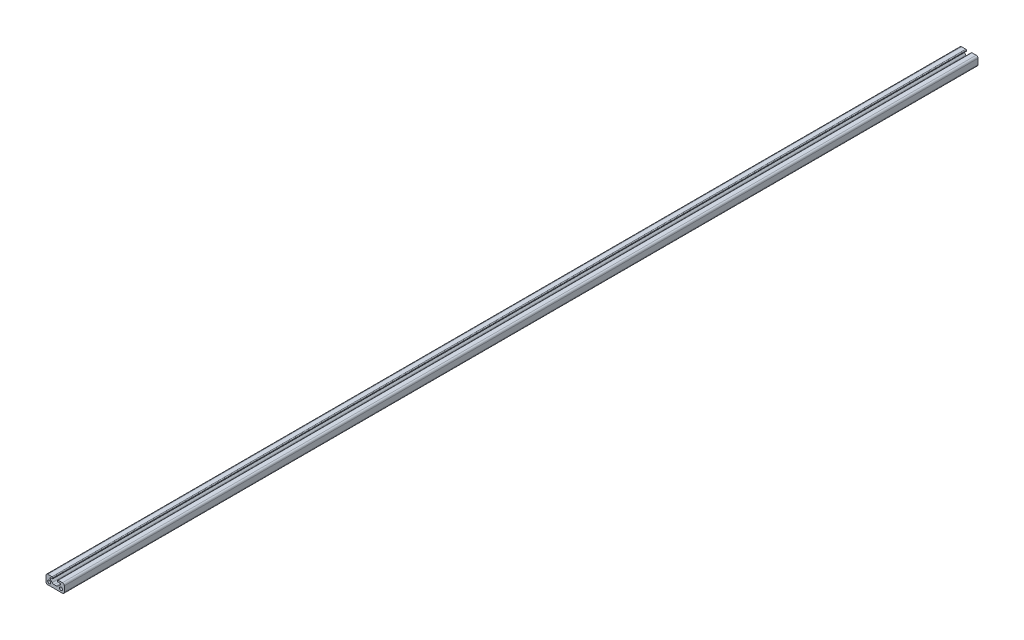
ISO-10303-21;
HEADER;
FILE_DESCRIPTION(('STEP AP214'),'2;1');
FILE_NAME('part.step','',(''),(''),'','','');
FILE_SCHEMA(('AUTOMOTIVE_DESIGN { 1 0 10303 214 1 1 1 1 }'));
ENDSEC;
DATA;
#1=APPLICATION_CONTEXT('core data for automotive mechanical design processes');
#2=APPLICATION_PROTOCOL_DEFINITION('international standard','automotive_design',2000,#1);
#3=PRODUCT_CONTEXT('',#1,'mechanical');
#4=PRODUCT('Part','Part','',(#3));
#5=PRODUCT_RELATED_PRODUCT_CATEGORY('part','',(#4));
#6=PRODUCT_DEFINITION_FORMATION('','',#4);
#7=PRODUCT_DEFINITION_CONTEXT('part definition',#1,'design');
#8=PRODUCT_DEFINITION('design','',#6,#7);
#9=PRODUCT_DEFINITION_SHAPE('','',#8);
#10=(LENGTH_UNIT() NAMED_UNIT(*) SI_UNIT(.MILLI.,.METRE.));
#11=(NAMED_UNIT(*) PLANE_ANGLE_UNIT() SI_UNIT($,.RADIAN.));
#12=(NAMED_UNIT(*) SI_UNIT($,.STERADIAN.) SOLID_ANGLE_UNIT());
#13=UNCERTAINTY_MEASURE_WITH_UNIT(LENGTH_MEASURE(1.E-05),#10,'distance_accuracy_value','');
#14=(GEOMETRIC_REPRESENTATION_CONTEXT(3) GLOBAL_UNCERTAINTY_ASSIGNED_CONTEXT((#13)) GLOBAL_UNIT_ASSIGNED_CONTEXT((#10,
#11,#12)) REPRESENTATION_CONTEXT('',''));
#15=CARTESIAN_POINT('',(0.,0.,0.));
#16=DIRECTION('',(0.,0.,1.));
#17=DIRECTION('',(1.,0.,0.));
#18=AXIS2_PLACEMENT_3D('',#15,#16,#17);
#19=CARTESIAN_POINT('',(10.575000000008,8.50000076294464,0.));
#20=DIRECTION('',(-1.,0.,0.));
#21=DIRECTION('',(0.,0.,1.));
#22=AXIS2_PLACEMENT_3D('',#19,#20,#21);
#23=PLANE('',#22);
#24=DIRECTION('',(0.,1.,0.));
#25=VECTOR('',#24,1.);
#26=CARTESIAN_POINT('',(10.575000000008,8.50000076294464,0.));
#27=LINE('',#26,#25);
#28=CARTESIAN_POINT('',(10.5750000000081,9.20000000000186,0.));
#29=VERTEX_POINT('',#28);
#30=CARTESIAN_POINT('',(10.5750000000071,8.50000076294464,0.));
#31=VERTEX_POINT('',#30);
#32=EDGE_CURVE('E198',#29,#31,#27,.F.);
#33=ORIENTED_EDGE('',*,*,#32,.T.);
#34=DIRECTION('',(0.,0.,1.));
#35=VECTOR('',#34,1.);
#36=CARTESIAN_POINT('',(10.5750000000062,8.50000076294464,0.));
#37=LINE('',#36,#35);
#38=CARTESIAN_POINT('',(10.5750000000071,8.50000076294464,1000.));
#39=VERTEX_POINT('',#38);
#40=EDGE_CURVE('E195',#39,#31,#37,.F.);
#41=ORIENTED_EDGE('',*,*,#40,.F.);
#42=DIRECTION('',(0.,1.,0.));
#43=VECTOR('',#42,1.);
#44=CARTESIAN_POINT('',(10.575000000008,8.50000076294464,1000.));
#45=LINE('',#44,#43);
#46=CARTESIAN_POINT('',(10.5750000000081,9.20000000000186,1000.));
#47=VERTEX_POINT('',#46);
#48=EDGE_CURVE('E178',#39,#47,#45,.T.);
#49=ORIENTED_EDGE('',*,*,#48,.T.);
#50=DIRECTION('',(0.,0.,1.));
#51=VECTOR('',#50,1.);
#52=CARTESIAN_POINT('',(10.5750000000081,9.19999999999845,0.));
#53=LINE('',#52,#51);
#54=EDGE_CURVE('E192',#29,#47,#53,.T.);
#55=ORIENTED_EDGE('',*,*,#54,.F.);
#56=EDGE_LOOP('',(#33,#41,#49,#55));
#57=FACE_BOUND('',#56,.T.);
#58=ADVANCED_FACE('F16',(#57),#23,.T.);
#59=CARTESIAN_POINT('',(5.42500000000473,9.20000000000073,0.));
#60=DIRECTION('',(1.,0.,0.));
#61=DIRECTION('',(0.,0.,-1.));
#62=AXIS2_PLACEMENT_3D('',#59,#60,#61);
#63=PLANE('',#62);
#64=DIRECTION('',(0.,1.,0.));
#65=VECTOR('',#64,1.);
#66=CARTESIAN_POINT('',(5.42500000000473,9.20000000000073,0.));
#67=LINE('',#66,#65);
#68=CARTESIAN_POINT('',(5.42500000000743,8.50000076294918,0.));
#69=VERTEX_POINT('',#68);
#70=CARTESIAN_POINT('',(5.42500000000643,9.19999999999845,0.));
#71=VERTEX_POINT('',#70);
#72=EDGE_CURVE('E189',#69,#71,#67,.T.);
#73=ORIENTED_EDGE('',*,*,#72,.T.);
#74=DIRECTION('',(0.,0.,1.));
#75=VECTOR('',#74,1.);
#76=CARTESIAN_POINT('',(5.42500000000814,9.19999999999845,0.));
#77=LINE('',#76,#75);
#78=CARTESIAN_POINT('',(5.42500000000643,9.19999999999845,1000.));
#79=VERTEX_POINT('',#78);
#80=EDGE_CURVE('E302',#79,#71,#77,.F.);
#81=ORIENTED_EDGE('',*,*,#80,.F.);
#82=DIRECTION('',(0.,1.,0.));
#83=VECTOR('',#82,1.);
#84=CARTESIAN_POINT('',(5.42500000000473,9.20000000000073,1000.));
#85=LINE('',#84,#83);
#86=CARTESIAN_POINT('',(5.42500000000743,8.50000076294918,1000.));
#87=VERTEX_POINT('',#86);
#88=EDGE_CURVE('E326',#79,#87,#85,.F.);
#89=ORIENTED_EDGE('',*,*,#88,.T.);
#90=DIRECTION('',(0.,0.,1.));
#91=VECTOR('',#90,1.);
#92=CARTESIAN_POINT('',(5.42500000001013,8.50000076294918,0.));
#93=LINE('',#92,#91);
#94=EDGE_CURVE('E307',#69,#87,#93,.T.);
#95=ORIENTED_EDGE('',*,*,#94,.F.);
#96=EDGE_LOOP('',(#73,#81,#89,#95));
#97=FACE_BOUND('',#96,.T.);
#98=ADVANCED_FACE('F506',(#97),#63,.T.);
#99=CARTESIAN_POINT('',(11.3750000000027,9.20000000000528,0.));
#100=DIRECTION('',(0.,0.,1.));
#101=DIRECTION('',(1.,0.,0.));
#102=AXIS2_PLACEMENT_3D('',#99,#100,#101);
#103=CYLINDRICAL_SURFACE('',#102,0.799999999994583);
#104=CARTESIAN_POINT('',(11.3750000000027,9.20000000000528,0.));
#105=DIRECTION('',(0.,0.,1.));
#106=DIRECTION('',(1.,0.,0.));
#107=AXIS2_PLACEMENT_3D('',#104,#105,#106);
#108=CIRCLE('',#107,0.799999999994583);
#109=CARTESIAN_POINT('',(11.375000000005,10.0000000000011,0.));
#110=VERTEX_POINT('',#109);
#111=EDGE_CURVE('E188',#110,#29,#108,.T.);
#112=ORIENTED_EDGE('',*,*,#111,.T.);
#113=ORIENTED_EDGE('',*,*,#54,.T.);
#114=CARTESIAN_POINT('',(11.3750000000027,9.20000000000528,1000.));
#115=DIRECTION('',(0.,0.,1.));
#116=DIRECTION('',(1.,0.,0.));
#117=AXIS2_PLACEMENT_3D('',#114,#115,#116);
#118=CIRCLE('',#117,0.799999999994583);
#119=CARTESIAN_POINT('',(11.375000000005,10.0000000000011,1000.));
#120=VERTEX_POINT('',#119);
#121=EDGE_CURVE('E19',#47,#120,#118,.F.);
#122=ORIENTED_EDGE('',*,*,#121,.T.);
#123=DIRECTION('',(0.,0.,1.));
#124=VECTOR('',#123,1.);
#125=CARTESIAN_POINT('',(11.3750000000073,10.0000000000023,0.));
#126=LINE('',#125,#124);
#127=EDGE_CURVE('E344',#110,#120,#126,.T.);
#128=ORIENTED_EDGE('',*,*,#127,.F.);
#129=EDGE_LOOP('',(#112,#113,#122,#128));
#130=FACE_BOUND('',#129,.T.);
#131=ADVANCED_FACE('F200',(#130),#103,.T.);
#132=CARTESIAN_POINT('',(10.8750000000055,8.50000076294464,0.));
#133=DIRECTION('',(0.,0.,1.));
#134=DIRECTION('',(1.,0.,0.));
#135=AXIS2_PLACEMENT_3D('',#132,#133,#134);
#136=CYLINDRICAL_SURFACE('',#135,0.299999999999301);
#137=CARTESIAN_POINT('',(10.8750000000055,8.50000076294464,0.));
#138=DIRECTION('',(0.,0.,1.));
#139=DIRECTION('',(1.,0.,0.));
#140=AXIS2_PLACEMENT_3D('',#137,#138,#139);
#141=CIRCLE('',#140,0.299999999999301);
#142=CARTESIAN_POINT('',(10.874999945961,8.20000076294491,0.));
#143=VERTEX_POINT('',#142);
#144=EDGE_CURVE('E315',#31,#143,#141,.T.);
#145=ORIENTED_EDGE('',*,*,#144,.T.);
#146=DIRECTION('',(0.,0.,1.));
#147=VECTOR('',#146,1.);
#148=CARTESIAN_POINT('',(10.8749998919166,8.20000076294491,0.));
#149=LINE('',#148,#147);
#150=CARTESIAN_POINT('',(10.874999945961,8.20000076294491,1000.));
#151=VERTEX_POINT('',#150);
#152=EDGE_CURVE('E347',#151,#143,#149,.F.);
#153=ORIENTED_EDGE('',*,*,#152,.F.);
#154=CARTESIAN_POINT('',(10.8750000000055,8.50000076294464,1000.));
#155=DIRECTION('',(0.,0.,1.));
#156=DIRECTION('',(1.,0.,0.));
#157=AXIS2_PLACEMENT_3D('',#154,#155,#156);
#158=CIRCLE('',#157,0.299999999999301);
#159=EDGE_CURVE('E202',#151,#39,#158,.F.);
#160=ORIENTED_EDGE('',*,*,#159,.T.);
#161=ORIENTED_EDGE('',*,*,#40,.T.);
#162=EDGE_LOOP('',(#145,#153,#160,#161));
#163=FACE_BOUND('',#162,.T.);
#164=ADVANCED_FACE('F494',(#163),#136,.T.);
#165=CARTESIAN_POINT('',(5.12500000000728,8.50000076294918,0.));
#166=DIRECTION('',(0.,0.,1.));
#167=DIRECTION('',(1.,0.,0.));
#168=AXIS2_PLACEMENT_3D('',#165,#166,#167);
#169=CYLINDRICAL_SURFACE('',#168,0.300000000002853);
#170=CARTESIAN_POINT('',(5.12500000000728,8.50000076294918,0.));
#171=DIRECTION('',(0.,0.,1.));
#172=DIRECTION('',(1.,0.,0.));
#173=AXIS2_PLACEMENT_3D('',#170,#171,#172);
#174=CIRCLE('',#173,0.300000000002853);
#175=CARTESIAN_POINT('',(5.12500005446782,8.2000003691735,0.));
#176=VERTEX_POINT('',#175);
#177=EDGE_CURVE('E308',#176,#69,#174,.T.);
#178=ORIENTED_EDGE('',*,*,#177,.T.);
#179=ORIENTED_EDGE('',*,*,#94,.T.);
#180=CARTESIAN_POINT('',(5.12500000000728,8.50000076294918,1000.));
#181=DIRECTION('',(0.,0.,1.));
#182=DIRECTION('',(1.,0.,0.));
#183=AXIS2_PLACEMENT_3D('',#180,#181,#182);
#184=CIRCLE('',#183,0.300000000002853);
#185=CARTESIAN_POINT('',(5.12500005446782,8.2000003691735,1000.));
#186=VERTEX_POINT('',#185);
#187=EDGE_CURVE('E312',#87,#186,#184,.F.);
#188=ORIENTED_EDGE('',*,*,#187,.T.);
#189=DIRECTION('',(0.,0.,1.));
#190=VECTOR('',#189,1.);
#191=CARTESIAN_POINT('',(5.12500010892836,8.20000076294491,0.));
#192=LINE('',#191,#190);
#193=EDGE_CURVE('E378',#176,#186,#192,.T.);
#194=ORIENTED_EDGE('',*,*,#193,.F.);
#195=EDGE_LOOP('',(#178,#179,#188,#194));
#196=FACE_BOUND('',#195,.T.);
#197=ADVANCED_FACE('F496',(#196),#169,.T.);
#198=CARTESIAN_POINT('',(4.62500000001,9.19999999999845,0.));
#199=DIRECTION('',(0.,0.,1.));
#200=DIRECTION('',(1.,0.,0.));
#201=AXIS2_PLACEMENT_3D('',#198,#199,#200);
#202=CYLINDRICAL_SURFACE('',#201,0.799999999998135);
#203=CARTESIAN_POINT('',(4.62500000001,9.19999999999845,0.));
#204=DIRECTION('',(0.,0.,1.));
#205=DIRECTION('',(1.,0.,0.));
#206=AXIS2_PLACEMENT_3D('',#203,#204,#205);
#207=CIRCLE('',#206,0.799999999998135);
#208=CARTESIAN_POINT('',(4.62500000000773,9.99999999999773,0.));
#209=VERTEX_POINT('',#208);
#210=EDGE_CURVE('E298',#71,#209,#207,.T.);
#211=ORIENTED_EDGE('',*,*,#210,.T.);
#212=DIRECTION('',(0.,0.,1.));
#213=VECTOR('',#212,1.);
#214=CARTESIAN_POINT('',(4.62500000000546,9.99999999999773,0.));
#215=LINE('',#214,#213);
#216=CARTESIAN_POINT('',(4.62500000000773,9.99999999999773,1000.));
#217=VERTEX_POINT('',#216);
#218=EDGE_CURVE('E382',#217,#209,#215,.F.);
#219=ORIENTED_EDGE('',*,*,#218,.F.);
#220=CARTESIAN_POINT('',(4.62500000001,9.19999999999845,1000.));
#221=DIRECTION('',(0.,0.,1.));
#222=DIRECTION('',(1.,0.,0.));
#223=AXIS2_PLACEMENT_3D('',#220,#221,#222);
#224=CIRCLE('',#223,0.799999999998135);
#225=EDGE_CURVE('E303',#217,#79,#224,.F.);
#226=ORIENTED_EDGE('',*,*,#225,.T.);
#227=ORIENTED_EDGE('',*,*,#80,.T.);
#228=EDGE_LOOP('',(#211,#219,#226,#227));
#229=FACE_BOUND('',#228,.T.);
#230=ADVANCED_FACE('F503',(#229),#202,.T.);
#231=CARTESIAN_POINT('',(16.0000000000082,7.99999999999955,0.));
#232=DIRECTION('',(0.,0.,1.));
#233=DIRECTION('',(1.,0.,0.));
#234=AXIS2_PLACEMENT_3D('',#231,#232,#233);
#235=CYLINDRICAL_SURFACE('',#234,1.99999999999889);
#236=CARTESIAN_POINT('',(16.0000000000082,7.99999999999955,0.));
#237=DIRECTION('',(0.,0.,1.));
#238=DIRECTION('',(1.,0.,0.));
#239=AXIS2_PLACEMENT_3D('',#236,#237,#238);
#240=CIRCLE('',#239,1.99999999999889);
#241=CARTESIAN_POINT('',(18.0000000000041,7.99999999999841,0.));
#242=VERTEX_POINT('',#241);
#243=CARTESIAN_POINT('',(16.0000000000082,10.,0.));
#244=VERTEX_POINT('',#243);
#245=EDGE_CURVE('E250',#242,#244,#240,.T.);
#246=ORIENTED_EDGE('',*,*,#245,.T.);
#247=DIRECTION('',(0.,0.,1.));
#248=VECTOR('',#247,1.);
#249=CARTESIAN_POINT('',(16.0000000000082,10.,0.));
#250=LINE('',#249,#248);
#251=CARTESIAN_POINT('',(16.0000000000082,10.,1000.));
#252=VERTEX_POINT('',#251);
#253=EDGE_CURVE('E301',#252,#244,#250,.F.);
#254=ORIENTED_EDGE('',*,*,#253,.F.);
#255=CARTESIAN_POINT('',(16.0000000000082,7.99999999999955,1000.));
#256=DIRECTION('',(0.,0.,1.));
#257=DIRECTION('',(1.,0.,0.));
#258=AXIS2_PLACEMENT_3D('',#255,#256,#257);
#259=CIRCLE('',#258,1.99999999999889);
#260=CARTESIAN_POINT('',(18.0000000000041,7.99999999999841,1000.));
#261=VERTEX_POINT('',#260);
#262=EDGE_CURVE('E294',#261,#252,#259,.T.);
#263=ORIENTED_EDGE('',*,*,#262,.F.);
#264=DIRECTION('',(0.,0.,1.));
#265=VECTOR('',#264,1.);
#266=CARTESIAN_POINT('',(18.0000000000064,7.99999999999727,0.));
#267=LINE('',#266,#265);
#268=EDGE_CURVE('E339',#242,#261,#267,.T.);
#269=ORIENTED_EDGE('',*,*,#268,.F.);
#270=EDGE_LOOP('',(#246,#254,#263,#269));
#271=FACE_BOUND('',#270,.T.);
#272=ADVANCED_FACE('F479',(#271),#235,.T.);
#273=CARTESIAN_POINT('',(11.3750000000073,10.0000000000023,0.));
#274=DIRECTION('',(4.916188E-13,1.,0.));
#275=DIRECTION('',(-1.,4.916188E-13,0.));
#276=AXIS2_PLACEMENT_3D('',#273,#274,#275);
#277=PLANE('',#276);
#278=DIRECTION('',(1.,0.,0.));
#279=VECTOR('',#278,1.);
#280=CARTESIAN_POINT('',(8.0000000011056,10.,0.));
#281=LINE('',#280,#279);
#282=EDGE_CURVE('E253',#244,#110,#281,.F.);
#283=ORIENTED_EDGE('',*,*,#282,.T.);
#284=ORIENTED_EDGE('',*,*,#127,.T.);
#285=DIRECTION('',(1.,0.,0.));
#286=VECTOR('',#285,1.);
#287=CARTESIAN_POINT('',(8.00000000110561,10.,1000.));
#288=LINE('',#287,#286);
#289=EDGE_CURVE('E182',#252,#120,#288,.F.);
#290=ORIENTED_EDGE('',*,*,#289,.F.);
#291=ORIENTED_EDGE('',*,*,#253,.T.);
#292=EDGE_LOOP('',(#283,#284,#290,#291));
#293=FACE_BOUND('',#292,.T.);
#294=ADVANCED_FACE('F482',(#293),#277,.T.);
#295=CARTESIAN_POINT('',(13.0441214776829,8.19999998142976,0.));
#296=DIRECTION('',(-3.60291078E-07,-0.999999999999935,0.));
#297=DIRECTION('',(0.999999999999935,-3.60291078E-07,0.));
#298=AXIS2_PLACEMENT_3D('',#295,#296,#297);
#299=PLANE('',#298);
#300=DIRECTION('',(1.,0.,0.));
#301=VECTOR('',#300,1.);
#302=CARTESIAN_POINT('',(8.0000000011056,8.20000076294491,0.));
#303=LINE('',#302,#301);
#304=CARTESIAN_POINT('',(13.0441213371682,8.20000037218916,0.));
#305=VERTEX_POINT('',#304);
#306=EDGE_CURVE('E249',#143,#305,#303,.T.);
#307=ORIENTED_EDGE('',*,*,#306,.T.);
#308=DIRECTION('',(0.,0.,1.));
#309=VECTOR('',#308,1.);
#310=CARTESIAN_POINT('',(13.0441214776829,8.1999999814334,0.));
#311=LINE('',#310,#309);
#312=CARTESIAN_POINT('',(13.0441213371682,8.20000037218916,1000.));
#313=VERTEX_POINT('',#312);
#314=EDGE_CURVE('E353',#305,#313,#311,.T.);
#315=ORIENTED_EDGE('',*,*,#314,.T.);
#316=DIRECTION('',(1.,0.,0.));
#317=VECTOR('',#316,1.);
#318=CARTESIAN_POINT('',(8.00000000110561,8.20000076294491,1000.));
#319=LINE('',#318,#317);
#320=EDGE_CURVE('E293',#151,#313,#319,.T.);
#321=ORIENTED_EDGE('',*,*,#320,.F.);
#322=ORIENTED_EDGE('',*,*,#152,.T.);
#323=EDGE_LOOP('',(#307,#315,#321,#322));
#324=FACE_BOUND('',#323,.T.);
#325=ADVANCED_FACE('F488',(#324),#299,.T.);
#326=CARTESIAN_POINT('',(13.0441211966536,7.41999998143456,0.));
#327=DIRECTION('',(0.,0.,1.));
#328=DIRECTION('',(1.,0.,0.));
#329=AXIS2_PLACEMENT_3D('',#326,#327,#328);
#330=CYLINDRICAL_SURFACE('',#329,0.779999999998893);
#331=ORIENTED_EDGE('',*,*,#314,.F.);
#332=CARTESIAN_POINT('',(13.0441211966536,7.41999998143456,0.));
#333=DIRECTION('',(0.,0.,1.));
#334=DIRECTION('',(1.,0.,0.));
#335=AXIS2_PLACEMENT_3D('',#332,#333,#334);
#336=CIRCLE('',#335,0.779999999998893);
#337=CARTESIAN_POINT('',(13.5956644859832,6.86845669210219,0.));
#338=VERTEX_POINT('',#337);
#339=EDGE_CURVE('E246',#305,#338,#336,.F.);
#340=ORIENTED_EDGE('',*,*,#339,.T.);
#341=DIRECTION('',(0.,0.,1.));
#342=VECTOR('',#341,1.);
#343=CARTESIAN_POINT('',(13.5956644859834,6.86845669210243,0.));
#344=LINE('',#343,#342);
#345=CARTESIAN_POINT('',(13.5956644859832,6.86845669210219,1000.));
#346=VERTEX_POINT('',#345);
#347=EDGE_CURVE('E356',#346,#338,#344,.F.);
#348=ORIENTED_EDGE('',*,*,#347,.F.);
#349=CARTESIAN_POINT('',(13.0441211966536,7.41999998143456,1000.));
#350=DIRECTION('',(0.,0.,1.));
#351=DIRECTION('',(1.,0.,0.));
#352=AXIS2_PLACEMENT_3D('',#349,#350,#351);
#353=CIRCLE('',#352,0.779999999998893);
#354=EDGE_CURVE('E289',#313,#346,#353,.F.);
#355=ORIENTED_EDGE('',*,*,#354,.F.);
#356=EDGE_LOOP('',(#331,#340,#348,#355));
#357=FACE_BOUND('',#356,.T.);
#358=ADVANCED_FACE('F492',(#357),#330,.F.);
#359=CARTESIAN_POINT('',(11.2558874551951,4.52867966132771,0.));
#360=DIRECTION('',(-0.707106781184486,0.707106781188609,0.));
#361=DIRECTION('',(-0.707106781188609,-0.707106781184486,0.));
#362=AXIS2_PLACEMENT_3D('',#359,#360,#361);
#363=PLANE('',#362);
#364=DIRECTION('',(-0.707106781188609,-0.707106781184486,0.));
#365=VECTOR('',#364,1.);
#366=CARTESIAN_POINT('',(13.5956644859834,6.86845669210243,0.));
#367=LINE('',#366,#365);
#368=CARTESIAN_POINT('',(11.255887455188,4.52867966132182,0.));
#369=VERTEX_POINT('',#368);
#370=EDGE_CURVE('E245',#338,#369,#367,.T.);
#371=ORIENTED_EDGE('',*,*,#370,.T.);
#372=DIRECTION('',(0.,0.,1.));
#373=VECTOR('',#372,1.);
#374=CARTESIAN_POINT('',(11.2558874551939,4.52867966132892,0.));
#375=LINE('',#374,#373);
#376=CARTESIAN_POINT('',(11.255887455188,4.52867966132182,1000.));
#377=VERTEX_POINT('',#376);
#378=EDGE_CURVE('E360',#369,#377,#375,.T.);
#379=ORIENTED_EDGE('',*,*,#378,.T.);
#380=DIRECTION('',(-0.707106781188609,-0.707106781184486,0.));
#381=VECTOR('',#380,1.);
#382=CARTESIAN_POINT('',(13.5956644859834,6.86845669210243,1000.));
#383=LINE('',#382,#381);
#384=EDGE_CURVE('E288',#346,#377,#383,.T.);
#385=ORIENTED_EDGE('',*,*,#384,.F.);
#386=ORIENTED_EDGE('',*,*,#347,.T.);
#387=EDGE_LOOP('',(#371,#379,#385,#386));
#388=FACE_BOUND('',#387,.T.);
#389=ADVANCED_FACE('F566',(#388),#363,.T.);
#390=CARTESIAN_POINT('',(9.13456711163235,6.6500000048768,0.));
#391=DIRECTION('',(0.,0.,1.));
#392=DIRECTION('',(1.,0.,0.));
#393=AXIS2_PLACEMENT_3D('',#390,#391,#392);
#394=CYLINDRICAL_SURFACE('',#393,2.99999999999301);
#395=ORIENTED_EDGE('',*,*,#378,.F.);
#396=CARTESIAN_POINT('',(9.13456711163235,6.6500000048768,0.));
#397=DIRECTION('',(0.,0.,1.));
#398=DIRECTION('',(1.,0.,0.));
#399=AXIS2_PLACEMENT_3D('',#396,#397,#398);
#400=CIRCLE('',#399,2.99999999999301);
#401=CARTESIAN_POINT('',(9.13456711475192,3.65000000488408,0.));
#402=VERTEX_POINT('',#401);
#403=EDGE_CURVE('E242',#369,#402,#400,.F.);
#404=ORIENTED_EDGE('',*,*,#403,.T.);
#405=DIRECTION('',(0.,0.,1.));
#406=VECTOR('',#405,1.);
#407=CARTESIAN_POINT('',(9.13456711787149,3.65000000488408,0.));
#408=LINE('',#407,#406);
#409=CARTESIAN_POINT('',(9.13456711475192,3.65000000488408,1000.));
#410=VERTEX_POINT('',#409);
#411=EDGE_CURVE('E363',#410,#402,#408,.F.);
#412=ORIENTED_EDGE('',*,*,#411,.F.);
#413=CARTESIAN_POINT('',(9.13456711163235,6.6500000048768,1000.));
#414=DIRECTION('',(0.,0.,1.));
#415=DIRECTION('',(1.,0.,0.));
#416=AXIS2_PLACEMENT_3D('',#413,#414,#415);
#417=CIRCLE('',#416,2.99999999999301);
#418=EDGE_CURVE('E284',#377,#410,#417,.F.);
#419=ORIENTED_EDGE('',*,*,#418,.F.);
#420=EDGE_LOOP('',(#395,#404,#412,#419));
#421=FACE_BOUND('',#420,.T.);
#422=ADVANCED_FACE('F562',(#421),#394,.F.);
#423=CARTESIAN_POINT('',(6.86543289934434,3.65000000016153,0.));
#424=DIRECTION('',(-2.081213E-09,1.,0.));
#425=DIRECTION('',(-1.,-2.081213E-09,0.));
#426=AXIS2_PLACEMENT_3D('',#423,#424,#425);
#427=PLANE('',#426);
#428=DIRECTION('',(1.,0.,0.));
#429=VECTOR('',#428,1.);
#430=CARTESIAN_POINT('',(8.0000000011056,3.65000000488408,0.));
#431=LINE('',#430,#429);
#432=CARTESIAN_POINT('',(6.86543289622477,3.65000000252287,0.));
#433=VERTEX_POINT('',#432);
#434=EDGE_CURVE('E241',#402,#433,#431,.F.);
#435=ORIENTED_EDGE('',*,*,#434,.T.);
#436=DIRECTION('',(0.,0.,1.));
#437=VECTOR('',#436,1.);
#438=CARTESIAN_POINT('',(6.86543289934434,3.65000000016167,0.));
#439=LINE('',#438,#437);
#440=CARTESIAN_POINT('',(6.86543289622477,3.65000000252287,1000.));
#441=VERTEX_POINT('',#440);
#442=EDGE_CURVE('E367',#433,#441,#439,.T.);
#443=ORIENTED_EDGE('',*,*,#442,.T.);
#444=DIRECTION('',(1.,0.,0.));
#445=VECTOR('',#444,1.);
#446=CARTESIAN_POINT('',(8.00000000110561,3.65000000488408,1000.));
#447=LINE('',#446,#445);
#448=EDGE_CURVE('E283',#410,#441,#447,.F.);
#449=ORIENTED_EDGE('',*,*,#448,.F.);
#450=ORIENTED_EDGE('',*,*,#411,.T.);
#451=EDGE_LOOP('',(#435,#443,#449,#450));
#452=FACE_BOUND('',#451,.T.);
#453=ADVANCED_FACE('F558',(#452),#427,.T.);
#454=CARTESIAN_POINT('',(6.86543289310521,6.65000000017244,0.));
#455=DIRECTION('',(0.,0.,1.));
#456=DIRECTION('',(1.,0.,0.));
#457=AXIS2_PLACEMENT_3D('',#454,#455,#456);
#458=CYLINDRICAL_SURFACE('',#457,3.00000000001077);
#459=ORIENTED_EDGE('',*,*,#442,.F.);
#460=CARTESIAN_POINT('',(6.86543289310521,6.65000000017244,0.));
#461=DIRECTION('',(0.,0.,1.));
#462=DIRECTION('',(1.,0.,0.));
#463=AXIS2_PLACEMENT_3D('',#460,#461,#462);
#464=CIRCLE('',#463,3.00000000001077);
#465=CARTESIAN_POINT('',(4.74411254954367,4.52867965660625,0.));
#466=VERTEX_POINT('',#465);
#467=EDGE_CURVE('E238',#433,#466,#464,.F.);
#468=ORIENTED_EDGE('',*,*,#467,.T.);
#469=DIRECTION('',(0.,0.,1.));
#470=VECTOR('',#469,1.);
#471=CARTESIAN_POINT('',(4.74411254954703,4.52867965660289,0.));
#472=LINE('',#471,#470);
#473=CARTESIAN_POINT('',(4.74411254954367,4.52867965660625,1000.));
#474=VERTEX_POINT('',#473);
#475=EDGE_CURVE('E370',#474,#466,#472,.F.);
#476=ORIENTED_EDGE('',*,*,#475,.F.);
#477=CARTESIAN_POINT('',(6.86543289310521,6.65000000017244,1000.));
#478=DIRECTION('',(0.,0.,1.));
#479=DIRECTION('',(1.,0.,0.));
#480=AXIS2_PLACEMENT_3D('',#477,#478,#479);
#481=CIRCLE('',#480,3.00000000001077);
#482=EDGE_CURVE('E279',#441,#474,#481,.F.);
#483=ORIENTED_EDGE('',*,*,#482,.F.);
#484=EDGE_LOOP('',(#459,#468,#476,#483));
#485=FACE_BOUND('',#484,.T.);
#486=ADVANCED_FACE('F554',(#485),#458,.F.);
#487=CARTESIAN_POINT('',(2.40433552007744,6.86845668607475,0.));
#488=DIRECTION('',(0.707106781186891,0.707106781186204,0.));
#489=DIRECTION('',(-0.707106781186204,0.707106781186891,0.));
#490=AXIS2_PLACEMENT_3D('',#487,#488,#489);
#491=PLANE('',#490);
#492=DIRECTION('',(-0.707106781186204,0.707106781186891,0.));
#493=VECTOR('',#492,1.);
#494=CARTESIAN_POINT('',(4.74411254954703,4.52867965660289,0.));
#495=LINE('',#494,#493);
#496=CARTESIAN_POINT('',(2.40433552007305,6.86845668607745,0.));
#497=VERTEX_POINT('',#496);
#498=EDGE_CURVE('E237',#466,#497,#495,.T.);
#499=ORIENTED_EDGE('',*,*,#498,.T.);
#500=DIRECTION('',(0.,0.,1.));
#501=VECTOR('',#500,1.);
#502=CARTESIAN_POINT('',(2.40433552007575,6.86845668607306,0.));
#503=LINE('',#502,#501);
#504=CARTESIAN_POINT('',(2.40433552007305,6.86845668607745,1000.));
#505=VERTEX_POINT('',#504);
#506=EDGE_CURVE('E374',#497,#505,#503,.T.);
#507=ORIENTED_EDGE('',*,*,#506,.T.);
#508=DIRECTION('',(-0.707106781186204,0.707106781186891,0.));
#509=VECTOR('',#508,1.);
#510=CARTESIAN_POINT('',(4.74411254954703,4.52867965660289,1000.));
#511=LINE('',#510,#509);
#512=EDGE_CURVE('E278',#474,#505,#511,.T.);
#513=ORIENTED_EDGE('',*,*,#512,.F.);
#514=ORIENTED_EDGE('',*,*,#475,.T.);
#515=EDGE_LOOP('',(#499,#507,#513,#514));
#516=FACE_BOUND('',#515,.T.);
#517=ADVANCED_FACE('F550',(#516),#491,.T.);
#518=CARTESIAN_POINT('',(2.95587880939365,7.41999997540461,0.));
#519=DIRECTION('',(0.,0.,1.));
#520=DIRECTION('',(1.,0.,0.));
#521=AXIS2_PLACEMENT_3D('',#518,#519,#520);
#522=CYLINDRICAL_SURFACE('',#521,0.779999999998893);
#523=ORIENTED_EDGE('',*,*,#506,.F.);
#524=CARTESIAN_POINT('',(2.95587880939365,7.41999997540461,0.));
#525=DIRECTION('',(0.,0.,1.));
#526=DIRECTION('',(1.,0.,0.));
#527=AXIS2_PLACEMENT_3D('',#524,#525,#526);
#528=CIRCLE('',#527,0.779999999998893);
#529=CARTESIAN_POINT('',(2.95587866779897,8.19999997540208,0.));
#530=VERTEX_POINT('',#529);
#531=EDGE_CURVE('E233',#497,#530,#528,.F.);
#532=ORIENTED_EDGE('',*,*,#531,.T.);
#533=DIRECTION('',(0.,0.,1.));
#534=VECTOR('',#533,1.);
#535=CARTESIAN_POINT('',(2.95587852620429,8.19999997540208,0.));
#536=LINE('',#535,#534);
#537=CARTESIAN_POINT('',(2.95587866779897,8.19999997540208,1000.));
#538=VERTEX_POINT('',#537);
#539=EDGE_CURVE('E377',#538,#530,#536,.F.);
#540=ORIENTED_EDGE('',*,*,#539,.F.);
#541=CARTESIAN_POINT('',(2.95587880939365,7.41999997540461,1000.));
#542=DIRECTION('',(0.,0.,1.));
#543=DIRECTION('',(1.,0.,0.));
#544=AXIS2_PLACEMENT_3D('',#541,#542,#543);
#545=CIRCLE('',#544,0.779999999998893);
#546=EDGE_CURVE('E273',#505,#538,#545,.F.);
#547=ORIENTED_EDGE('',*,*,#546,.F.);
#548=EDGE_LOOP('',(#523,#532,#540,#547));
#549=FACE_BOUND('',#548,.T.);
#550=ADVANCED_FACE('F546',(#549),#522,.F.);
#551=CARTESIAN_POINT('',(5.12500010892836,8.20000076294491,0.));
#552=DIRECTION('',(3.63069934E-07,-0.999999999999934,0.));
#553=DIRECTION('',(0.999999999999934,3.63069934E-07,0.));
#554=AXIS2_PLACEMENT_3D('',#551,#552,#553);
#555=PLANE('',#554);
#556=DIRECTION('',(1.,0.,0.));
#557=VECTOR('',#556,1.);
#558=CARTESIAN_POINT('',(8.0000000011056,8.19999997540208,0.));
#559=LINE('',#558,#557);
#560=EDGE_CURVE('E236',#530,#176,#559,.T.);
#561=ORIENTED_EDGE('',*,*,#560,.T.);
#562=ORIENTED_EDGE('',*,*,#193,.T.);
#563=DIRECTION('',(1.,0.,0.));
#564=VECTOR('',#563,1.);
#565=CARTESIAN_POINT('',(8.00000000110561,8.19999997540208,1000.));
#566=LINE('',#565,#564);
#567=EDGE_CURVE('E277',#538,#186,#566,.T.);
#568=ORIENTED_EDGE('',*,*,#567,.F.);
#569=ORIENTED_EDGE('',*,*,#539,.T.);
#570=EDGE_LOOP('',(#561,#562,#568,#569));
#571=FACE_BOUND('',#570,.T.);
#572=ADVANCED_FACE('F542',(#571),#555,.T.);
#573=CARTESIAN_POINT('',(4.547474E-12,10.0000000000091,0.));
#574=DIRECTION('',(2.458094E-12,1.,0.));
#575=DIRECTION('',(-1.,2.458094E-12,0.));
#576=AXIS2_PLACEMENT_3D('',#573,#574,#575);
#577=PLANE('',#576);
#578=DIRECTION('',(1.,0.,0.));
#579=VECTOR('',#578,1.);
#580=CARTESIAN_POINT('',(8.0000000011056,9.99999999999773,0.));
#581=LINE('',#580,#579);
#582=CARTESIAN_POINT('',(4.54753523233996E-12,10.0000000000026,0.));
#583=VERTEX_POINT('',#582);
#584=EDGE_CURVE('E232',#209,#583,#581,.F.);
#585=ORIENTED_EDGE('',*,*,#584,.T.);
#586=DIRECTION('',(0.,0.,1.));
#587=VECTOR('',#586,1.);
#588=CARTESIAN_POINT('',(4.54759646467991E-12,10.0000000000075,0.));
#589=LINE('',#588,#587);
#590=CARTESIAN_POINT('',(4.54753523233996E-12,10.0000000000026,1000.));
#591=VERTEX_POINT('',#590);
#592=EDGE_CURVE('E389',#591,#583,#589,.F.);
#593=ORIENTED_EDGE('',*,*,#592,.F.);
#594=DIRECTION('',(1.,0.,0.));
#595=VECTOR('',#594,1.);
#596=CARTESIAN_POINT('',(8.00000000110561,9.99999999999773,1000.));
#597=LINE('',#596,#595);
#598=EDGE_CURVE('E272',#217,#591,#597,.F.);
#599=ORIENTED_EDGE('',*,*,#598,.F.);
#600=ORIENTED_EDGE('',*,*,#218,.T.);
#601=EDGE_LOOP('',(#585,#593,#599,#600));
#602=FACE_BOUND('',#601,.T.);
#603=ADVANCED_FACE('F538',(#602),#577,.T.);
#604=CARTESIAN_POINT('',(4.547474E-12,8.00000000000864,0.));
#605=DIRECTION('',(0.,0.,1.));
#606=DIRECTION('',(1.,0.,0.));
#607=AXIS2_PLACEMENT_3D('',#604,#605,#606);
#608=CYLINDRICAL_SURFACE('',#607,1.99999999999889);
#609=CARTESIAN_POINT('',(4.547474E-12,8.00000000000864,0.));
#610=DIRECTION('',(0.,0.,1.));
#611=DIRECTION('',(1.,0.,0.));
#612=AXIS2_PLACEMENT_3D('',#609,#610,#611);
#613=CIRCLE('',#612,1.99999999999889);
#614=CARTESIAN_POINT('',(-1.99999999999363,8.00000000000864,0.));
#615=VERTEX_POINT('',#614);
#616=EDGE_CURVE('E229',#583,#615,#613,.T.);
#617=ORIENTED_EDGE('',*,*,#616,.T.);
#618=DIRECTION('',(0.,0.,1.));
#619=VECTOR('',#618,1.);
#620=CARTESIAN_POINT('',(-1.99999999999363,8.00000000000864,0.));
#621=LINE('',#620,#619);
#622=CARTESIAN_POINT('',(-1.99999999999363,8.00000000000864,1000.));
#623=VERTEX_POINT('',#622);
#624=EDGE_CURVE('E343',#623,#615,#621,.F.);
#625=ORIENTED_EDGE('',*,*,#624,.F.);
#626=CARTESIAN_POINT('',(4.547474E-12,8.00000000000864,1000.));
#627=DIRECTION('',(0.,0.,1.));
#628=DIRECTION('',(1.,0.,0.));
#629=AXIS2_PLACEMENT_3D('',#626,#627,#628);
#630=CIRCLE('',#629,1.99999999999889);
#631=EDGE_CURVE('E268',#591,#623,#630,.T.);
#632=ORIENTED_EDGE('',*,*,#631,.F.);
#633=ORIENTED_EDGE('',*,*,#592,.T.);
#634=EDGE_LOOP('',(#617,#625,#632,#633));
#635=FACE_BOUND('',#634,.T.);
#636=ADVANCED_FACE('F535',(#635),#608,.T.);
#637=CARTESIAN_POINT('',(-1.99999999999818,2.00000000000728,0.));
#638=DIRECTION('',(-1.,7.579123E-13,0.));
#639=DIRECTION('',(-7.579123E-13,-1.,0.));
#640=AXIS2_PLACEMENT_3D('',#637,#638,#639);
#641=PLANE('',#640);
#642=DIRECTION('',(0.,1.,0.));
#643=VECTOR('',#642,1.);
#644=CARTESIAN_POINT('',(-1.99999999999363,5.08964232037461,0.));
#645=LINE('',#644,#643);
#646=CARTESIAN_POINT('',(-1.99999999999804,2.00000000000728,0.));
#647=VERTEX_POINT('',#646);
#648=EDGE_CURVE('E228',#615,#647,#645,.F.);
#649=ORIENTED_EDGE('',*,*,#648,.T.);
#650=DIRECTION('',(0.,0.,1.));
#651=VECTOR('',#650,1.);
#652=CARTESIAN_POINT('',(-2.00000000000244,2.00000000000728,0.));
#653=LINE('',#652,#651);
#654=CARTESIAN_POINT('',(-1.99999999999804,2.00000000000728,1000.));
#655=VERTEX_POINT('',#654);
#656=EDGE_CURVE('E259',#655,#647,#653,.F.);
#657=ORIENTED_EDGE('',*,*,#656,.F.);
#658=DIRECTION('',(0.,1.,0.));
#659=VECTOR('',#658,1.);
#660=CARTESIAN_POINT('',(-1.99999999999363,5.08964232037461,1000.));
#661=LINE('',#660,#659);
#662=EDGE_CURVE('E342',#623,#655,#661,.F.);
#663=ORIENTED_EDGE('',*,*,#662,.F.);
#664=ORIENTED_EDGE('',*,*,#624,.T.);
#665=EDGE_LOOP('',(#649,#657,#663,#664));
#666=FACE_BOUND('',#665,.T.);
#667=ADVANCED_FACE('F460',(#666),#641,.T.);
#668=CARTESIAN_POINT('',(1.50000000000091,3.50000000000591,0.));
#669=DIRECTION('',(0.,0.,1.));
#670=DIRECTION('',(1.,0.,0.));
#671=AXIS2_PLACEMENT_3D('',#668,#669,#670);
#672=CYLINDRICAL_SURFACE('',#671,1.65000000000148);
#673=CARTESIAN_POINT('',(1.50000000000091,3.50000000000591,0.));
#674=DIRECTION('',(0.,0.,1.));
#675=DIRECTION('',(1.,0.,0.));
#676=AXIS2_PLACEMENT_3D('',#673,#674,#675);
#677=CIRCLE('',#676,1.65000000000148);
#678=CARTESIAN_POINT('',(3.15000000000239,3.50000000000591,0.));
#679=VERTEX_POINT('',#678);
#680=EDGE_CURVE('E221',#679,#679,#677,.F.);
#681=ORIENTED_EDGE('',*,*,#680,.T.);
#682=EDGE_LOOP('',(#681));
#683=FACE_BOUND('',#682,.T.);
#684=CARTESIAN_POINT('',(1.50000000000091,3.50000000000591,1000.));
#685=DIRECTION('',(0.,0.,1.));
#686=DIRECTION('',(1.,0.,0.));
#687=AXIS2_PLACEMENT_3D('',#684,#685,#686);
#688=CIRCLE('',#687,1.65000000000148);
#689=CARTESIAN_POINT('',(3.15000000000239,3.50000000000591,1000.));
#690=VERTEX_POINT('',#689);
#691=EDGE_CURVE('E264',#690,#690,#688,.F.);
#692=ORIENTED_EDGE('',*,*,#691,.F.);
#693=EDGE_LOOP('',(#692));
#694=FACE_BOUND('',#693,.T.);
#695=ADVANCED_FACE('F528',(#683,#694),#672,.F.);
#696=CARTESIAN_POINT('',(14.5000000000027,3.49999999999909,0.));
#697=DIRECTION('',(0.,0.,1.));
#698=DIRECTION('',(1.,0.,0.));
#699=AXIS2_PLACEMENT_3D('',#696,#697,#698);
#700=CYLINDRICAL_SURFACE('',#699,1.65000000000148);
#701=CARTESIAN_POINT('',(14.5000000000027,3.49999999999909,0.));
#702=DIRECTION('',(0.,0.,1.));
#703=DIRECTION('',(1.,0.,0.));
#704=AXIS2_PLACEMENT_3D('',#701,#702,#703);
#705=CIRCLE('',#704,1.65000000000148);
#706=CARTESIAN_POINT('',(16.1500000000042,3.49999999999909,0.));
#707=VERTEX_POINT('',#706);
#708=EDGE_CURVE('E217',#707,#707,#705,.F.);
#709=ORIENTED_EDGE('',*,*,#708,.T.);
#710=EDGE_LOOP('',(#709));
#711=FACE_BOUND('',#710,.T.);
#712=CARTESIAN_POINT('',(14.5000000000027,3.49999999999909,1000.));
#713=DIRECTION('',(0.,0.,1.));
#714=DIRECTION('',(1.,0.,0.));
#715=AXIS2_PLACEMENT_3D('',#712,#713,#714);
#716=CIRCLE('',#715,1.65000000000148);
#717=CARTESIAN_POINT('',(16.1500000000042,3.49999999999909,1000.));
#718=VERTEX_POINT('',#717);
#719=EDGE_CURVE('E260',#718,#718,#716,.F.);
#720=ORIENTED_EDGE('',*,*,#719,.F.);
#721=EDGE_LOOP('',(#720));
#722=FACE_BOUND('',#721,.T.);
#723=ADVANCED_FACE('F525',(#711,#722),#700,.F.);
#724=CARTESIAN_POINT('',(18.0000000000064,7.99999999999727,0.));
#725=DIRECTION('',(1.,-7.579123E-13,0.));
#726=DIRECTION('',(7.579123E-13,1.,0.));
#727=AXIS2_PLACEMENT_3D('',#724,#725,#726);
#728=PLANE('',#727);
#729=DIRECTION('',(0.,1.,0.));
#730=VECTOR('',#729,1.);
#731=CARTESIAN_POINT('',(18.0000000000018,5.08964232037461,0.));
#732=LINE('',#731,#730);
#733=CARTESIAN_POINT('',(18.0000000000022,1.99999999999818,0.));
#734=VERTEX_POINT('',#733);
#735=EDGE_CURVE('E254',#734,#242,#732,.T.);
#736=ORIENTED_EDGE('',*,*,#735,.T.);
#737=ORIENTED_EDGE('',*,*,#268,.T.);
#738=DIRECTION('',(0.,1.,0.));
#739=VECTOR('',#738,1.);
#740=CARTESIAN_POINT('',(18.0000000000018,5.08964232037461,1000.));
#741=LINE('',#740,#739);
#742=CARTESIAN_POINT('',(18.0000000000022,1.99999999999818,1000.));
#743=VERTEX_POINT('',#742);
#744=EDGE_CURVE('E297',#743,#261,#741,.T.);
#745=ORIENTED_EDGE('',*,*,#744,.F.);
#746=DIRECTION('',(0.,0.,1.));
#747=VECTOR('',#746,1.);
#748=CARTESIAN_POINT('',(18.0000000000025,1.99999999999818,0.));
#749=LINE('',#748,#747);
#750=EDGE_CURVE('E212',#734,#743,#749,.T.);
#751=ORIENTED_EDGE('',*,*,#750,.F.);
#752=EDGE_LOOP('',(#736,#737,#745,#751));
#753=FACE_BOUND('',#752,.T.);
#754=ADVANCED_FACE('F475',(#753),#728,.T.);
#755=CARTESIAN_POINT('',(8.00000000110561,5.08964232037461,1000.));
#756=DIRECTION('',(0.,0.,1.));
#757=DIRECTION('',(1.,0.,0.));
#758=AXIS2_PLACEMENT_3D('',#755,#756,#757);
#759=PLANE('',#758);
#760=ORIENTED_EDGE('',*,*,#719,.T.);
#761=EDGE_LOOP('',(#760));
#762=FACE_BOUND('',#761,.T.);
#763=ORIENTED_EDGE('',*,*,#691,.T.);
#764=EDGE_LOOP('',(#763));
#765=FACE_BOUND('',#764,.T.);
#766=ORIENTED_EDGE('',*,*,#598,.T.);
#767=ORIENTED_EDGE('',*,*,#631,.T.);
#768=ORIENTED_EDGE('',*,*,#662,.T.);
#769=CARTESIAN_POINT('',(0.,2.00000000000728,1000.));
#770=DIRECTION('',(0.,0.,1.));
#771=DIRECTION('',(1.,0.,0.));
#772=AXIS2_PLACEMENT_3D('',#769,#770,#771);
#773=CIRCLE('',#772,2.00000000000244);
#774=CARTESIAN_POINT('',(0.,0.,1000.));
#775=VERTEX_POINT('',#774);
#776=EDGE_CURVE('E255',#775,#655,#773,.F.);
#777=ORIENTED_EDGE('',*,*,#776,.F.);
#778=DIRECTION('',(1.,0.,0.));
#779=VECTOR('',#778,1.);
#780=CARTESIAN_POINT('',(16.0000000000036,0.,1000.));
#781=LINE('',#780,#779);
#782=CARTESIAN_POINT('',(16.0000000000036,0.,1000.));
#783=VERTEX_POINT('',#782);
#784=EDGE_CURVE('E402',#783,#775,#781,.F.);
#785=ORIENTED_EDGE('',*,*,#784,.F.);
#786=CARTESIAN_POINT('',(16.0000000000036,1.99999999999818,1000.));
#787=DIRECTION('',(0.,0.,1.));
#788=DIRECTION('',(1.,0.,0.));
#789=AXIS2_PLACEMENT_3D('',#786,#787,#788);
#790=CIRCLE('',#789,1.99999999999889);
#791=EDGE_CURVE('E213',#743,#783,#790,.F.);
#792=ORIENTED_EDGE('',*,*,#791,.F.);
#793=ORIENTED_EDGE('',*,*,#744,.T.);
#794=ORIENTED_EDGE('',*,*,#262,.T.);
#795=ORIENTED_EDGE('',*,*,#289,.T.);
#796=ORIENTED_EDGE('',*,*,#121,.F.);
#797=ORIENTED_EDGE('',*,*,#48,.F.);
#798=ORIENTED_EDGE('',*,*,#159,.F.);
#799=ORIENTED_EDGE('',*,*,#320,.T.);
#800=ORIENTED_EDGE('',*,*,#354,.T.);
#801=ORIENTED_EDGE('',*,*,#384,.T.);
#802=ORIENTED_EDGE('',*,*,#418,.T.);
#803=ORIENTED_EDGE('',*,*,#448,.T.);
#804=ORIENTED_EDGE('',*,*,#482,.T.);
#805=ORIENTED_EDGE('',*,*,#512,.T.);
#806=ORIENTED_EDGE('',*,*,#546,.T.);
#807=ORIENTED_EDGE('',*,*,#567,.T.);
#808=ORIENTED_EDGE('',*,*,#187,.F.);
#809=ORIENTED_EDGE('',*,*,#88,.F.);
#810=ORIENTED_EDGE('',*,*,#225,.F.);
#811=EDGE_LOOP('',(#766,#767,#768,#777,#785,#792,#793,#794,#795,#796,#797,#798,#799,#800,#801,
#802,#803,#804,#805,#806,#807,#808,#809,#810));
#812=FACE_BOUND('',#811,.T.);
#813=ADVANCED_FACE('F177',(#762,#765,#812),#759,.T.);
#814=CARTESIAN_POINT('',(0.,2.00000000000728,0.));
#815=DIRECTION('',(0.,0.,1.));
#816=DIRECTION('',(1.,0.,0.));
#817=AXIS2_PLACEMENT_3D('',#814,#815,#816);
#818=CYLINDRICAL_SURFACE('',#817,2.00000000000244);
#819=CARTESIAN_POINT('',(0.,2.00000000000728,0.));
#820=DIRECTION('',(0.,0.,1.));
#821=DIRECTION('',(1.,0.,0.));
#822=AXIS2_PLACEMENT_3D('',#819,#820,#821);
#823=CIRCLE('',#822,2.00000000000244);
#824=CARTESIAN_POINT('',(0.,0.,0.));
#825=VERTEX_POINT('',#824);
#826=EDGE_CURVE('E225',#647,#825,#823,.T.);
#827=ORIENTED_EDGE('',*,*,#826,.T.);
#828=DIRECTION('',(0.,0.,-1.));
#829=VECTOR('',#828,1.);
#830=CARTESIAN_POINT('',(0.,0.,0.));
#831=LINE('',#830,#829);
#832=EDGE_CURVE('E429',#775,#825,#831,.T.);
#833=ORIENTED_EDGE('',*,*,#832,.F.);
#834=ORIENTED_EDGE('',*,*,#776,.T.);
#835=ORIENTED_EDGE('',*,*,#656,.T.);
#836=EDGE_LOOP('',(#827,#833,#834,#835));
#837=FACE_BOUND('',#836,.T.);
#838=ADVANCED_FACE('F465',(#837),#818,.T.);
#839=CARTESIAN_POINT('',(8.0000000011056,5.08964232037461,0.));
#840=DIRECTION('',(0.,0.,1.));
#841=DIRECTION('',(1.,0.,0.));
#842=AXIS2_PLACEMENT_3D('',#839,#840,#841);
#843=PLANE('',#842);
#844=ORIENTED_EDGE('',*,*,#708,.F.);
#845=EDGE_LOOP('',(#844));
#846=FACE_BOUND('',#845,.T.);
#847=ORIENTED_EDGE('',*,*,#680,.F.);
#848=EDGE_LOOP('',(#847));
#849=FACE_BOUND('',#848,.T.);
#850=ORIENTED_EDGE('',*,*,#648,.F.);
#851=ORIENTED_EDGE('',*,*,#616,.F.);
#852=ORIENTED_EDGE('',*,*,#584,.F.);
#853=ORIENTED_EDGE('',*,*,#210,.F.);
#854=ORIENTED_EDGE('',*,*,#72,.F.);
#855=ORIENTED_EDGE('',*,*,#177,.F.);
#856=ORIENTED_EDGE('',*,*,#560,.F.);
#857=ORIENTED_EDGE('',*,*,#531,.F.);
#858=ORIENTED_EDGE('',*,*,#498,.F.);
#859=ORIENTED_EDGE('',*,*,#467,.F.);
#860=ORIENTED_EDGE('',*,*,#434,.F.);
#861=ORIENTED_EDGE('',*,*,#403,.F.);
#862=ORIENTED_EDGE('',*,*,#370,.F.);
#863=ORIENTED_EDGE('',*,*,#339,.F.);
#864=ORIENTED_EDGE('',*,*,#306,.F.);
#865=ORIENTED_EDGE('',*,*,#144,.F.);
#866=ORIENTED_EDGE('',*,*,#32,.F.);
#867=ORIENTED_EDGE('',*,*,#111,.F.);
#868=ORIENTED_EDGE('',*,*,#282,.F.);
#869=ORIENTED_EDGE('',*,*,#245,.F.);
#870=ORIENTED_EDGE('',*,*,#735,.F.);
#871=CARTESIAN_POINT('',(16.0000000000036,1.99999999999818,0.));
#872=DIRECTION('',(0.,0.,1.));
#873=DIRECTION('',(1.,0.,0.));
#874=AXIS2_PLACEMENT_3D('',#871,#872,#873);
#875=CIRCLE('',#874,1.99999999999889);
#876=CARTESIAN_POINT('',(16.0000000000036,0.,0.));
#877=VERTEX_POINT('',#876);
#878=EDGE_CURVE('E35',#877,#734,#875,.T.);
#879=ORIENTED_EDGE('',*,*,#878,.F.);
#880=DIRECTION('',(1.,0.,0.));
#881=VECTOR('',#880,1.);
#882=CARTESIAN_POINT('',(16.0000000000036,0.,0.));
#883=LINE('',#882,#881);
#884=EDGE_CURVE('E26',#825,#877,#883,.T.);
#885=ORIENTED_EDGE('',*,*,#884,.F.);
#886=ORIENTED_EDGE('',*,*,#826,.F.);
#887=EDGE_LOOP('',(#850,#851,#852,#853,#854,#855,#856,#857,#858,#859,#860,#861,#862,#863,#864,
#865,#866,#867,#868,#869,#870,#879,#885,#886));
#888=FACE_BOUND('',#887,.T.);
#889=ADVANCED_FACE('F467',(#846,#849,#888),#843,.F.);
#890=CARTESIAN_POINT('',(16.0000000000036,1.99999999999818,0.));
#891=DIRECTION('',(0.,0.,1.));
#892=DIRECTION('',(1.,0.,0.));
#893=AXIS2_PLACEMENT_3D('',#890,#891,#892);
#894=CYLINDRICAL_SURFACE('',#893,1.99999999999889);
#895=ORIENTED_EDGE('',*,*,#878,.T.);
#896=ORIENTED_EDGE('',*,*,#750,.T.);
#897=ORIENTED_EDGE('',*,*,#791,.T.);
#898=DIRECTION('',(0.,0.,-1.));
#899=VECTOR('',#898,1.);
#900=CARTESIAN_POINT('',(16.0000000000036,0.,0.));
#901=LINE('',#900,#899);
#902=EDGE_CURVE('E10',#877,#783,#901,.F.);
#903=ORIENTED_EDGE('',*,*,#902,.F.);
#904=EDGE_LOOP('',(#895,#896,#897,#903));
#905=FACE_BOUND('',#904,.T.);
#906=ADVANCED_FACE('F472',(#905),#894,.T.);
#907=CARTESIAN_POINT('',(16.0000000000036,0.,0.));
#908=DIRECTION('',(0.,-1.,0.));
#909=DIRECTION('',(0.,0.,-1.));
#910=AXIS2_PLACEMENT_3D('',#907,#908,#909);
#911=PLANE('',#910);
#912=ORIENTED_EDGE('',*,*,#884,.T.);
#913=ORIENTED_EDGE('',*,*,#902,.T.);
#914=ORIENTED_EDGE('',*,*,#784,.T.);
#915=ORIENTED_EDGE('',*,*,#832,.T.);
#916=EDGE_LOOP('',(#912,#913,#914,#915));
#917=FACE_BOUND('',#916,.T.);
#918=ADVANCED_FACE('F469',(#917),#911,.T.);
#919=CLOSED_SHELL('',(#58,#98,#131,#164,#197,#230,#272,#294,#325,#358,#389,#422,#453,#486,#517,
#550,#572,#603,#636,#667,#695,#723,#754,#813,#838,#889,#906,#918));
#920=MANIFOLD_SOLID_BREP('B1',#919);
#921=ADVANCED_BREP_SHAPE_REPRESENTATION('',(#18,#920),#14);
#922=SHAPE_DEFINITION_REPRESENTATION(#9,#921);
ENDSEC;
END-ISO-10303-21;
